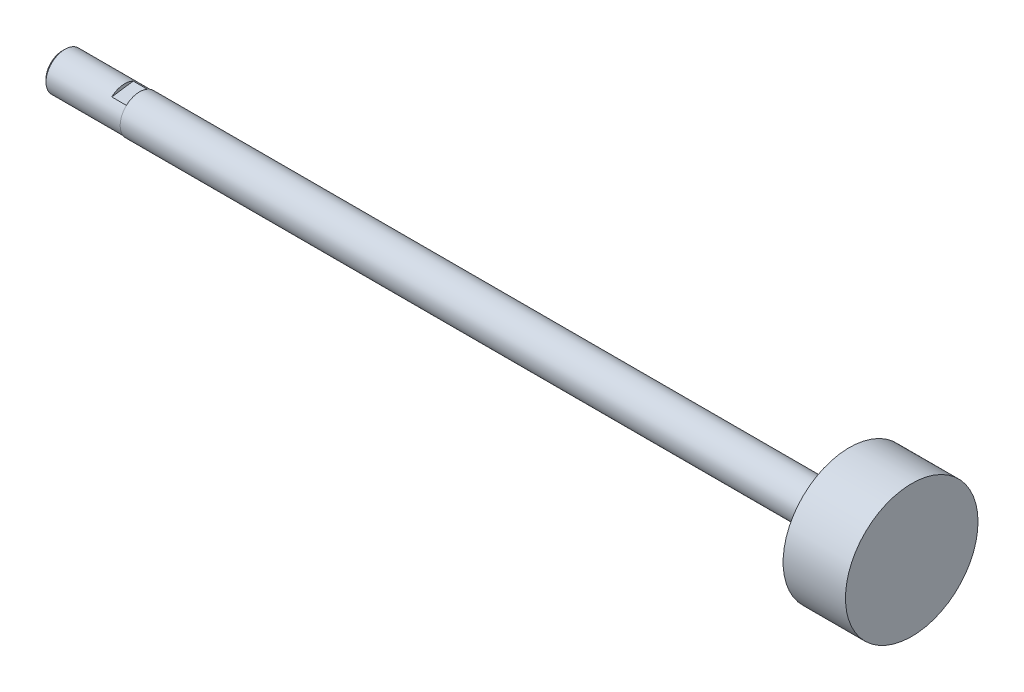
ISO-10303-21;
HEADER;
FILE_DESCRIPTION(('STEP AP214'),'2;1');
FILE_NAME('part.step','',(''),(''),'','','');
FILE_SCHEMA(('AUTOMOTIVE_DESIGN { 1 0 10303 214 1 1 1 1 }'));
ENDSEC;
DATA;
#1=APPLICATION_CONTEXT('core data for automotive mechanical design processes');
#2=APPLICATION_PROTOCOL_DEFINITION('international standard','automotive_design',2000,#1);
#3=PRODUCT_CONTEXT('',#1,'mechanical');
#4=PRODUCT('Part','Part','',(#3));
#5=PRODUCT_RELATED_PRODUCT_CATEGORY('part','',(#4));
#6=PRODUCT_DEFINITION_FORMATION('','',#4);
#7=PRODUCT_DEFINITION_CONTEXT('part definition',#1,'design');
#8=PRODUCT_DEFINITION('design','',#6,#7);
#9=PRODUCT_DEFINITION_SHAPE('','',#8);
#10=(LENGTH_UNIT() NAMED_UNIT(*) SI_UNIT(.MILLI.,.METRE.));
#11=(NAMED_UNIT(*) PLANE_ANGLE_UNIT() SI_UNIT($,.RADIAN.));
#12=(NAMED_UNIT(*) SI_UNIT($,.STERADIAN.) SOLID_ANGLE_UNIT());
#13=UNCERTAINTY_MEASURE_WITH_UNIT(LENGTH_MEASURE(1.E-05),#10,'distance_accuracy_value','');
#14=(GEOMETRIC_REPRESENTATION_CONTEXT(3) GLOBAL_UNCERTAINTY_ASSIGNED_CONTEXT((#13)) GLOBAL_UNIT_ASSIGNED_CONTEXT((#10,
#11,#12)) REPRESENTATION_CONTEXT('',''));
#15=CARTESIAN_POINT('',(0.,0.,0.));
#16=DIRECTION('',(0.,0.,1.));
#17=DIRECTION('',(1.,0.,0.));
#18=AXIS2_PLACEMENT_3D('',#15,#16,#17);
#19=CARTESIAN_POINT('',(732.849890202522,0.,0.));
#20=DIRECTION('',(-1.,0.,0.));
#21=DIRECTION('',(0.,-1.,0.));
#22=AXIS2_PLACEMENT_3D('',#19,#20,#21);
#23=PLANE('',#22);
#24=CARTESIAN_POINT('',(732.849890202544,0.,0.));
#25=DIRECTION('',(1.,0.,0.));
#26=DIRECTION('',(0.,0.,-1.));
#27=AXIS2_PLACEMENT_3D('',#24,#25,#26);
#28=CIRCLE('',#27,3.32739999998921);
#29=CARTESIAN_POINT('',(732.849890202544,0.,-3.32739999998921));
#30=VERTEX_POINT('',#29);
#31=EDGE_CURVE('E24',#30,#30,#28,.T.);
#32=ORIENTED_EDGE('',*,*,#31,.F.);
#33=EDGE_LOOP('',(#32));
#34=FACE_BOUND('',#33,.T.);
#35=ADVANCED_FACE('F21',(#34),#23,.T.);
#36=CARTESIAN_POINT('',(905.823890202522,0.,0.));
#37=DIRECTION('',(-1.,0.,0.));
#38=DIRECTION('',(0.,0.,1.));
#39=AXIS2_PLACEMENT_3D('',#36,#37,#38);
#40=PLANE('',#39);
#41=CARTESIAN_POINT('',(905.823890202522,0.,0.));
#42=DIRECTION('',(1.,0.,0.));
#43=DIRECTION('',(0.,0.,-1.));
#44=AXIS2_PLACEMENT_3D('',#41,#42,#43);
#45=CIRCLE('',#44,13.49375);
#46=CARTESIAN_POINT('',(905.823890202522,0.,-13.49375));
#47=VERTEX_POINT('',#46);
#48=EDGE_CURVE('E91',#47,#47,#45,.F.);
#49=ORIENTED_EDGE('',*,*,#48,.F.);
#50=EDGE_LOOP('',(#49));
#51=FACE_BOUND('',#50,.T.);
#52=ADVANCED_FACE('F105',(#51),#40,.F.);
#53=CARTESIAN_POINT('',(745.549890202522,-11.9515483613719,-17.0878721451101));
#54=DIRECTION('',(-1.,0.,0.));
#55=DIRECTION('',(0.,-1.,0.));
#56=AXIS2_PLACEMENT_3D('',#53,#54,#55);
#57=PLANE('',#56);
#58=CARTESIAN_POINT('',(745.549890202522,0.,0.));
#59=DIRECTION('',(1.,0.,0.));
#60=DIRECTION('',(0.,0.,-1.));
#61=AXIS2_PLACEMENT_3D('',#58,#59,#60);
#62=CIRCLE('',#61,3.86334);
#63=CARTESIAN_POINT('',(745.549890202522,-2.8359484783064,-2.62350761081258));
#64=VERTEX_POINT('',#63);
#65=CARTESIAN_POINT('',(745.549890202522,-3.45163861124236,1.73539242045737));
#66=VERTEX_POINT('',#65);
#67=EDGE_CURVE('E66',#64,#66,#62,.F.);
#68=ORIENTED_EDGE('',*,*,#67,.F.);
#69=DIRECTION('',(0.,-0.13986065989846,0.99017119520453));
#70=VECTOR('',#69,1.);
#71=CARTESIAN_POINT('',(745.549890202522,-1.01114682555708,-15.542551713892));
#72=LINE('',#71,#70);
#73=EDGE_CURVE('E61',#64,#66,#72,.T.);
#74=ORIENTED_EDGE('',*,*,#73,.T.);
#75=EDGE_LOOP('',(#68,#74));
#76=FACE_BOUND('',#75,.T.);
#77=ADVANCED_FACE('F64',(#76),#57,.F.);
#78=CARTESIAN_POINT('',(733.385830202508,0.,0.));
#79=DIRECTION('',(1.,0.,0.));
#80=DIRECTION('',(0.,0.,-1.));
#81=AXIS2_PLACEMENT_3D('',#78,#79,#80);
#82=CONICAL_SURFACE('',#81,3.86333999995259,0.785398163397448);
#83=CARTESIAN_POINT('',(733.385830202522,0.,0.));
#84=DIRECTION('',(1.,0.,0.));
#85=DIRECTION('',(0.,0.,-1.));
#86=AXIS2_PLACEMENT_3D('',#83,#84,#85);
#87=CIRCLE('',#86,3.86334);
#88=CARTESIAN_POINT('',(733.385830202522,0.,-3.86333999999999));
#89=VERTEX_POINT('',#88);
#90=EDGE_CURVE('E78',#89,#89,#87,.T.);
#91=ORIENTED_EDGE('',*,*,#90,.F.);
#92=EDGE_LOOP('',(#91));
#93=FACE_BOUND('',#92,.T.);
#94=ORIENTED_EDGE('',*,*,#31,.T.);
#95=EDGE_LOOP('',(#94));
#96=FACE_BOUND('',#95,.T.);
#97=ADVANCED_FACE('F102',(#93,#96),#82,.T.);
#98=CARTESIAN_POINT('',(745.549890202522,16.2168417998065,-13.1091160923187));
#99=DIRECTION('',(-1.,0.,0.));
#100=DIRECTION('',(0.,0.,1.));
#101=AXIS2_PLACEMENT_3D('',#98,#99,#100);
#102=PLANE('',#101);
#103=CARTESIAN_POINT('',(745.549890202522,0.,0.));
#104=DIRECTION('',(1.,0.,0.));
#105=DIRECTION('',(0.,0.,-1.));
#106=AXIS2_PLACEMENT_3D('',#103,#104,#105);
#107=CIRCLE('',#106,3.86334);
#108=CARTESIAN_POINT('',(745.549890202522,2.8359484783064,2.62350761081259));
#109=VERTEX_POINT('',#108);
#110=CARTESIAN_POINT('',(745.549890202522,3.45163861124236,-1.73539242045736));
#111=VERTEX_POINT('',#110);
#112=EDGE_CURVE('E89',#109,#111,#107,.F.);
#113=ORIENTED_EDGE('',*,*,#112,.F.);
#114=DIRECTION('',(0.,0.13986065989846,-0.99017119520453));
#115=VECTOR('',#114,1.);
#116=CARTESIAN_POINT('',(745.549890202522,5.27644026399168,-14.6544365235368));
#117=LINE('',#116,#115);
#118=EDGE_CURVE('E70',#109,#111,#117,.T.);
#119=ORIENTED_EDGE('',*,*,#118,.T.);
#120=EDGE_LOOP('',(#113,#119));
#121=FACE_BOUND('',#120,.T.);
#122=ADVANCED_FACE('F137',(#121),#102,.F.);
#123=CARTESIAN_POINT('',(893.123890202522,0.,0.));
#124=DIRECTION('',(1.,0.,0.));
#125=DIRECTION('',(0.,0.,-1.));
#126=AXIS2_PLACEMENT_3D('',#123,#124,#125);
#127=CYLINDRICAL_SURFACE('',#126,13.49375);
#128=ORIENTED_EDGE('',*,*,#48,.T.);
#129=EDGE_LOOP('',(#128));
#130=FACE_BOUND('',#129,.T.);
#131=CARTESIAN_POINT('',(893.123890202522,0.,0.));
#132=DIRECTION('',(1.,0.,0.));
#133=DIRECTION('',(0.,0.,-1.));
#134=AXIS2_PLACEMENT_3D('',#131,#132,#133);
#135=CIRCLE('',#134,13.49375);
#136=CARTESIAN_POINT('',(893.123890202522,0.,-13.49375));
#137=VERTEX_POINT('',#136);
#138=EDGE_CURVE('E261',#137,#137,#135,.F.);
#139=ORIENTED_EDGE('',*,*,#138,.F.);
#140=EDGE_LOOP('',(#139));
#141=FACE_BOUND('',#140,.T.);
#142=ADVANCED_FACE('F133',(#130,#141),#127,.T.);
#143=CARTESIAN_POINT('',(745.549890202522,5.27644026399168,-14.6544365235368));
#144=DIRECTION('',(0.,-0.99017119520453,-0.13986065989846));
#145=DIRECTION('',(0.,0.13986065989846,-0.99017119520453));
#146=AXIS2_PLACEMENT_3D('',#143,#144,#145);
#147=PLANE('',#146);
#148=DIRECTION('',(1.,0.,0.));
#149=VECTOR('',#148,1.);
#150=CARTESIAN_POINT('',(745.549890202522,2.8359484783064,2.62350761081259));
#151=LINE('',#150,#149);
#152=CARTESIAN_POINT('',(748.597890202522,2.8359484783064,2.62350761081259));
#153=VERTEX_POINT('',#152);
#154=EDGE_CURVE('E242',#153,#109,#151,.F.);
#155=ORIENTED_EDGE('',*,*,#154,.F.);
#156=DIRECTION('',(0.,0.13986065989846,-0.99017119520453));
#157=VECTOR('',#156,1.);
#158=CARTESIAN_POINT('',(748.597890202522,2.8359484783064,2.62350761081259));
#159=LINE('',#158,#157);
#160=CARTESIAN_POINT('',(748.597890202522,3.45163861124236,-1.73539242045736));
#161=VERTEX_POINT('',#160);
#162=EDGE_CURVE('E256',#153,#161,#159,.T.);
#163=ORIENTED_EDGE('',*,*,#162,.T.);
#164=DIRECTION('',(1.,0.,0.));
#165=VECTOR('',#164,1.);
#166=CARTESIAN_POINT('',(745.549890202522,3.45163861124236,-1.73539242045736));
#167=LINE('',#166,#165);
#168=EDGE_CURVE('E248',#111,#161,#167,.T.);
#169=ORIENTED_EDGE('',*,*,#168,.F.);
#170=ORIENTED_EDGE('',*,*,#118,.F.);
#171=EDGE_LOOP('',(#155,#163,#169,#170));
#172=FACE_BOUND('',#171,.T.);
#173=ADVANCED_FACE('F130',(#172),#147,.F.);
#174=CARTESIAN_POINT('',(745.549890202522,-1.01114682555708,-15.542551713892));
#175=DIRECTION('',(0.,0.99017119520453,0.13986065989846));
#176=DIRECTION('',(0.,-0.13986065989846,0.99017119520453));
#177=AXIS2_PLACEMENT_3D('',#174,#175,#176);
#178=PLANE('',#177);
#179=DIRECTION('',(1.,0.,0.));
#180=VECTOR('',#179,1.);
#181=CARTESIAN_POINT('',(745.549890202522,-2.8359484783064,-2.62350761081259));
#182=LINE('',#181,#180);
#183=CARTESIAN_POINT('',(748.597890202522,-2.8359484783064,-2.62350761081259));
#184=VERTEX_POINT('',#183);
#185=EDGE_CURVE('E69',#184,#64,#182,.F.);
#186=ORIENTED_EDGE('',*,*,#185,.F.);
#187=DIRECTION('',(0.,-0.139860659898461,0.99017119520453));
#188=VECTOR('',#187,1.);
#189=CARTESIAN_POINT('',(748.597890202522,-2.8359484783064,-2.62350761081259));
#190=LINE('',#189,#188);
#191=CARTESIAN_POINT('',(748.597890202522,-3.45163861124236,1.73539242045737));
#192=VERTEX_POINT('',#191);
#193=EDGE_CURVE('E75',#184,#192,#190,.T.);
#194=ORIENTED_EDGE('',*,*,#193,.T.);
#195=DIRECTION('',(1.,0.,0.));
#196=VECTOR('',#195,1.);
#197=CARTESIAN_POINT('',(745.549890202522,-3.45163861124236,1.73539242045737));
#198=LINE('',#197,#196);
#199=EDGE_CURVE('E73',#66,#192,#198,.T.);
#200=ORIENTED_EDGE('',*,*,#199,.F.);
#201=ORIENTED_EDGE('',*,*,#73,.F.);
#202=EDGE_LOOP('',(#186,#194,#200,#201));
#203=FACE_BOUND('',#202,.T.);
#204=ADVANCED_FACE('F74',(#203),#178,.F.);
#205=CARTESIAN_POINT('',(745.549890202522,0.,0.));
#206=DIRECTION('',(1.,0.,0.));
#207=DIRECTION('',(0.,0.,-1.));
#208=AXIS2_PLACEMENT_3D('',#205,#206,#207);
#209=CYLINDRICAL_SURFACE('',#208,3.86334);
#210=ORIENTED_EDGE('',*,*,#199,.T.);
#211=CARTESIAN_POINT('',(748.597890202522,0.,0.));
#212=DIRECTION('',(1.,0.,0.));
#213=DIRECTION('',(0.,0.,-1.));
#214=AXIS2_PLACEMENT_3D('',#211,#212,#213);
#215=CIRCLE('',#214,3.86334);
#216=EDGE_CURVE('E41',#192,#153,#215,.F.);
#217=ORIENTED_EDGE('',*,*,#216,.T.);
#218=ORIENTED_EDGE('',*,*,#154,.T.);
#219=ORIENTED_EDGE('',*,*,#112,.T.);
#220=ORIENTED_EDGE('',*,*,#168,.T.);
#221=CARTESIAN_POINT('',(748.597890202522,0.,0.));
#222=DIRECTION('',(1.,0.,0.));
#223=DIRECTION('',(0.,0.,-1.));
#224=AXIS2_PLACEMENT_3D('',#221,#222,#223);
#225=CIRCLE('',#224,3.86334);
#226=EDGE_CURVE('E260',#161,#184,#225,.F.);
#227=ORIENTED_EDGE('',*,*,#226,.T.);
#228=ORIENTED_EDGE('',*,*,#185,.T.);
#229=ORIENTED_EDGE('',*,*,#67,.T.);
#230=EDGE_LOOP('',(#210,#217,#218,#219,#220,#227,#228,#229));
#231=FACE_BOUND('',#230,.T.);
#232=ORIENTED_EDGE('',*,*,#90,.T.);
#233=EDGE_LOOP('',(#232));
#234=FACE_BOUND('',#233,.T.);
#235=ADVANCED_FACE('F80',(#231,#234),#209,.T.);
#236=CARTESIAN_POINT('',(893.123890202522,0.,0.));
#237=DIRECTION('',(-1.,0.,0.));
#238=DIRECTION('',(0.,0.,1.));
#239=AXIS2_PLACEMENT_3D('',#236,#237,#238);
#240=PLANE('',#239);
#241=ORIENTED_EDGE('',*,*,#138,.T.);
#242=EDGE_LOOP('',(#241));
#243=FACE_BOUND('',#242,.T.);
#244=CARTESIAN_POINT('',(893.123890202522,0.,0.));
#245=DIRECTION('',(-1.,0.,0.));
#246=DIRECTION('',(0.,-1.,0.));
#247=AXIS2_PLACEMENT_3D('',#244,#245,#246);
#248=CIRCLE('',#247,3.9624);
#249=CARTESIAN_POINT('',(893.123890202522,-3.9624,0.));
#250=VERTEX_POINT('',#249);
#251=EDGE_CURVE('E32',#250,#250,#248,.T.);
#252=ORIENTED_EDGE('',*,*,#251,.F.);
#253=EDGE_LOOP('',(#252));
#254=FACE_BOUND('',#253,.T.);
#255=ADVANCED_FACE('F118',(#243,#254),#240,.T.);
#256=CARTESIAN_POINT('',(748.597890202522,14.0841950805892,1.9893780263957));
#257=DIRECTION('',(1.,0.,0.));
#258=DIRECTION('',(0.,0.,-1.));
#259=AXIS2_PLACEMENT_3D('',#256,#257,#258);
#260=PLANE('',#259);
#261=CARTESIAN_POINT('',(748.597890202522,0.,0.));
#262=DIRECTION('',(-1.,0.,0.));
#263=DIRECTION('',(0.,-1.,0.));
#264=AXIS2_PLACEMENT_3D('',#261,#262,#263);
#265=CIRCLE('',#264,3.9624);
#266=CARTESIAN_POINT('',(748.597890202522,-3.9624,0.));
#267=VERTEX_POINT('',#266);
#268=EDGE_CURVE('E12',#267,#267,#265,.F.);
#269=ORIENTED_EDGE('',*,*,#268,.F.);
#270=EDGE_LOOP('',(#269));
#271=FACE_BOUND('',#270,.T.);
#272=ORIENTED_EDGE('',*,*,#216,.F.);
#273=ORIENTED_EDGE('',*,*,#193,.F.);
#274=ORIENTED_EDGE('',*,*,#226,.F.);
#275=ORIENTED_EDGE('',*,*,#162,.F.);
#276=EDGE_LOOP('',(#272,#273,#274,#275));
#277=FACE_BOUND('',#276,.T.);
#278=ADVANCED_FACE('F112',(#271,#277),#260,.F.);
#279=CARTESIAN_POINT('',(917.031249841617,0.,0.));
#280=DIRECTION('',(-1.,0.,0.));
#281=DIRECTION('',(0.,-1.,0.));
#282=AXIS2_PLACEMENT_3D('',#279,#280,#281);
#283=CYLINDRICAL_SURFACE('',#282,3.9624);
#284=ORIENTED_EDGE('',*,*,#268,.T.);
#285=EDGE_LOOP('',(#284));
#286=FACE_BOUND('',#285,.T.);
#287=ORIENTED_EDGE('',*,*,#251,.T.);
#288=EDGE_LOOP('',(#287));
#289=FACE_BOUND('',#288,.T.);
#290=ADVANCED_FACE('F110',(#286,#289),#283,.T.);
#291=CLOSED_SHELL('',(#35,#52,#77,#97,#122,#142,#173,#204,#235,#255,#278,#290));
#292=MANIFOLD_SOLID_BREP('B1',#291);
#293=ADVANCED_BREP_SHAPE_REPRESENTATION('',(#18,#292),#14);
#294=SHAPE_DEFINITION_REPRESENTATION(#9,#293);
ENDSEC;
END-ISO-10303-21;
